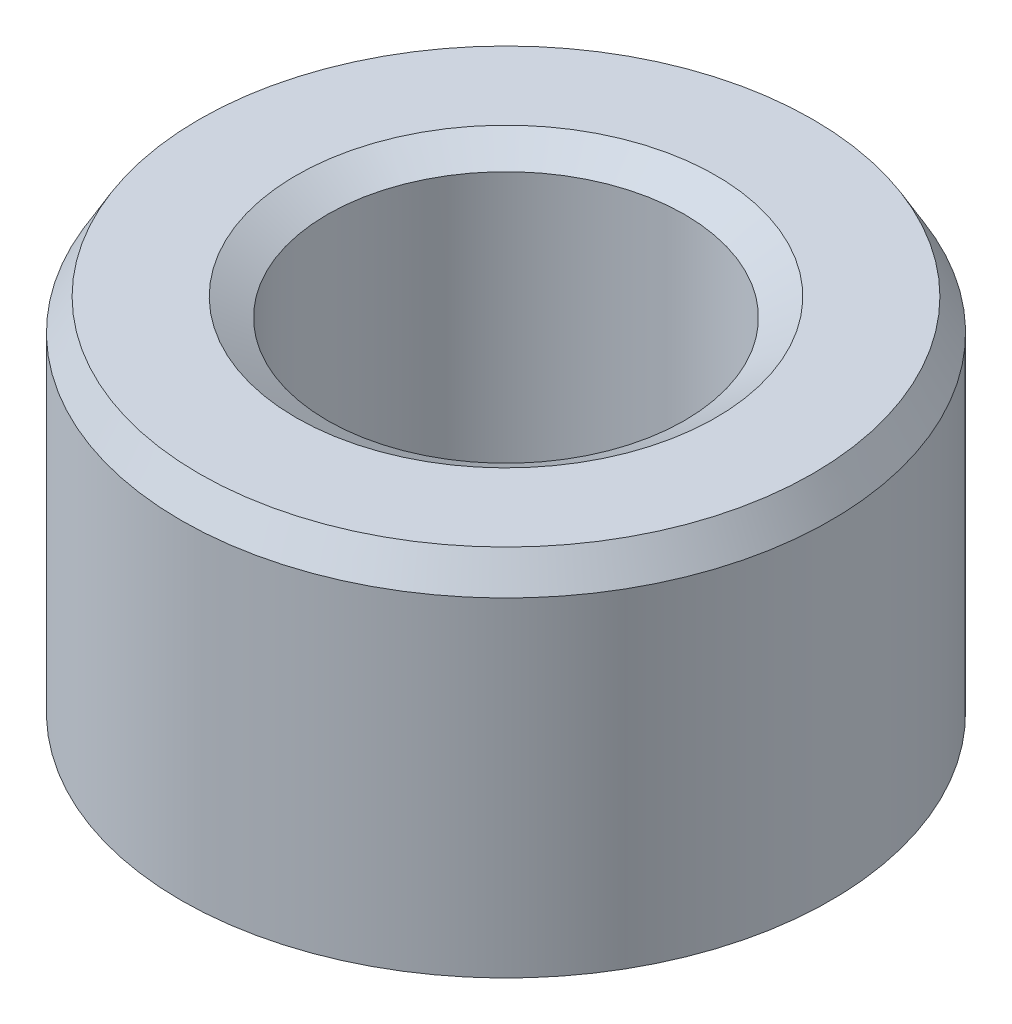
ISO-10303-21;
HEADER;
FILE_DESCRIPTION(('STEP AP214'),'2;1');
FILE_NAME('part.step','',(''),(''),'','','');
FILE_SCHEMA(('AUTOMOTIVE_DESIGN { 1 0 10303 214 1 1 1 1 }'));
ENDSEC;
DATA;
#1=APPLICATION_CONTEXT('core data for automotive mechanical design processes');
#2=APPLICATION_PROTOCOL_DEFINITION('international standard','automotive_design',2000,#1);
#3=PRODUCT_CONTEXT('',#1,'mechanical');
#4=PRODUCT('Part','Part','',(#3));
#5=PRODUCT_RELATED_PRODUCT_CATEGORY('part','',(#4));
#6=PRODUCT_DEFINITION_FORMATION('','',#4);
#7=PRODUCT_DEFINITION_CONTEXT('part definition',#1,'design');
#8=PRODUCT_DEFINITION('design','',#6,#7);
#9=PRODUCT_DEFINITION_SHAPE('','',#8);
#10=(LENGTH_UNIT() NAMED_UNIT(*) SI_UNIT(.MILLI.,.METRE.));
#11=(NAMED_UNIT(*) PLANE_ANGLE_UNIT() SI_UNIT($,.RADIAN.));
#12=(NAMED_UNIT(*) SI_UNIT($,.STERADIAN.) SOLID_ANGLE_UNIT());
#13=UNCERTAINTY_MEASURE_WITH_UNIT(LENGTH_MEASURE(1.E-05),#10,'distance_accuracy_value','');
#14=(GEOMETRIC_REPRESENTATION_CONTEXT(3) GLOBAL_UNCERTAINTY_ASSIGNED_CONTEXT((#13)) GLOBAL_UNIT_ASSIGNED_CONTEXT((#10,
#11,#12)) REPRESENTATION_CONTEXT('',''));
#15=CARTESIAN_POINT('',(0.,0.,0.));
#16=DIRECTION('',(0.,0.,1.));
#17=DIRECTION('',(1.,0.,0.));
#18=AXIS2_PLACEMENT_3D('',#15,#16,#17);
#19=CARTESIAN_POINT('',(0.,37.856817679339,0.));
#20=DIRECTION('',(0.,-1.,0.));
#21=DIRECTION('',(0.,0.,-1.));
#22=AXIS2_PLACEMENT_3D('',#19,#20,#21);
#23=CYLINDRICAL_SURFACE('',#22,32.5);
#24=CARTESIAN_POINT('',(0.,1.81448583222493,0.));
#25=DIRECTION('',(0.,1.,0.));
#26=DIRECTION('',(0.,0.,1.));
#27=AXIS2_PLACEMENT_3D('',#24,#25,#26);
#28=CIRCLE('',#27,32.5);
#29=CARTESIAN_POINT('',(0.,1.81448583222493,32.5));
#30=VERTEX_POINT('',#29);
#31=EDGE_CURVE('E10',#30,#30,#28,.T.);
#32=ORIENTED_EDGE('',*,*,#31,.T.);
#33=EDGE_LOOP('',(#32));
#34=FACE_BOUND('',#33,.T.);
#35=CARTESIAN_POINT('',(0.,34.7248591698607,0.));
#36=DIRECTION('',(0.,1.,0.));
#37=DIRECTION('',(0.,0.,1.));
#38=AXIS2_PLACEMENT_3D('',#35,#36,#37);
#39=CIRCLE('',#38,32.5);
#40=CARTESIAN_POINT('',(0.,34.7248591698607,32.5));
#41=VERTEX_POINT('',#40);
#42=EDGE_CURVE('E50',#41,#41,#39,.F.);
#43=ORIENTED_EDGE('',*,*,#42,.T.);
#44=EDGE_LOOP('',(#43));
#45=FACE_BOUND('',#44,.T.);
#46=ADVANCED_FACE('F39',(#34,#45),#23,.T.);
#47=CARTESIAN_POINT('',(0.,37.856817679339,0.));
#48=DIRECTION('',(0.,1.,0.));
#49=DIRECTION('',(0.,0.,1.));
#50=AXIS2_PLACEMENT_3D('',#47,#48,#49);
#51=PLANE('',#50);
#52=CARTESIAN_POINT('',(0.,37.856817679339,0.));
#53=DIRECTION('',(0.,1.,0.));
#54=DIRECTION('',(0.,0.,1.));
#55=AXIS2_PLACEMENT_3D('',#52,#53,#54);
#56=CIRCLE('',#55,20.9881499443453);
#57=CARTESIAN_POINT('',(0.,37.856817679339,20.9881499443453));
#58=VERTEX_POINT('',#57);
#59=EDGE_CURVE('E58',#58,#58,#56,.F.);
#60=ORIENTED_EDGE('',*,*,#59,.T.);
#61=EDGE_LOOP('',(#60));
#62=FACE_BOUND('',#61,.T.);
#63=CARTESIAN_POINT('',(0.,37.856817679339,0.));
#64=DIRECTION('',(0.,1.,0.));
#65=DIRECTION('',(0.,0.,1.));
#66=AXIS2_PLACEMENT_3D('',#63,#64,#65);
#67=CIRCLE('',#66,30.6855141677751);
#68=CARTESIAN_POINT('',(0.,37.856817679339,30.6855141677751));
#69=VERTEX_POINT('',#68);
#70=EDGE_CURVE('E61',#69,#69,#67,.T.);
#71=ORIENTED_EDGE('',*,*,#70,.T.);
#72=EDGE_LOOP('',(#71));
#73=FACE_BOUND('',#72,.T.);
#74=ADVANCED_FACE('F88',(#62,#73),#51,.T.);
#75=CARTESIAN_POINT('',(0.,0.,0.));
#76=DIRECTION('',(0.,1.,0.));
#77=DIRECTION('',(0.,0.,1.));
#78=AXIS2_PLACEMENT_3D('',#75,#76,#77);
#79=PLANE('',#78);
#80=CARTESIAN_POINT('',(0.,0.,0.));
#81=DIRECTION('',(0.,1.,0.));
#82=DIRECTION('',(0.,0.,1.));
#83=AXIS2_PLACEMENT_3D('',#80,#81,#82);
#84=CIRCLE('',#83,19.670677267092);
#85=CARTESIAN_POINT('',(0.,0.,-19.670677267092));
#86=VERTEX_POINT('',#85);
#87=EDGE_CURVE('E51',#86,#86,#84,.T.);
#88=ORIENTED_EDGE('',*,*,#87,.T.);
#89=EDGE_LOOP('',(#88));
#90=FACE_BOUND('',#89,.T.);
#91=CARTESIAN_POINT('',(0.,0.,0.));
#92=DIRECTION('',(0.,1.,0.));
#93=DIRECTION('',(0.,0.,1.));
#94=AXIS2_PLACEMENT_3D('',#91,#92,#93);
#95=CIRCLE('',#94,29.3680414905218);
#96=CARTESIAN_POINT('',(0.,0.,29.3680414905218));
#97=VERTEX_POINT('',#96);
#98=EDGE_CURVE('E54',#97,#97,#95,.F.);
#99=ORIENTED_EDGE('',*,*,#98,.T.);
#100=EDGE_LOOP('',(#99));
#101=FACE_BOUND('',#100,.T.);
#102=ADVANCED_FACE('F83',(#90,#101),#79,.F.);
#103=CARTESIAN_POINT('',(0.,37.856817679339,0.));
#104=DIRECTION('',(0.,-1.,0.));
#105=DIRECTION('',(0.,0.,-1.));
#106=AXIS2_PLACEMENT_3D('',#103,#104,#105);
#107=CYLINDRICAL_SURFACE('',#106,17.8561914348671);
#108=CARTESIAN_POINT('',(0.,36.042331847114,0.));
#109=DIRECTION('',(0.,1.,0.));
#110=DIRECTION('',(0.,0.,1.));
#111=AXIS2_PLACEMENT_3D('',#108,#109,#110);
#112=CIRCLE('',#111,17.8561914348671);
#113=CARTESIAN_POINT('',(0.,36.042331847114,17.8561914348671));
#114=VERTEX_POINT('',#113);
#115=EDGE_CURVE('E67',#114,#114,#112,.T.);
#116=ORIENTED_EDGE('',*,*,#115,.T.);
#117=EDGE_LOOP('',(#116));
#118=FACE_BOUND('',#117,.T.);
#119=CARTESIAN_POINT('',(0.,3.13195850947821,0.));
#120=DIRECTION('',(0.,1.,0.));
#121=DIRECTION('',(0.,0.,1.));
#122=AXIS2_PLACEMENT_3D('',#119,#120,#121);
#123=CIRCLE('',#122,17.8561914348671);
#124=CARTESIAN_POINT('',(0.,3.13195850947821,-17.8561914348671));
#125=VERTEX_POINT('',#124);
#126=EDGE_CURVE('E69',#125,#125,#123,.F.);
#127=ORIENTED_EDGE('',*,*,#126,.T.);
#128=EDGE_LOOP('',(#127));
#129=FACE_BOUND('',#128,.T.);
#130=ADVANCED_FACE('F71',(#118,#129),#107,.F.);
#131=CARTESIAN_POINT('',(0.,36.042331847114,0.));
#132=DIRECTION('',(0.,1.,0.));
#133=DIRECTION('',(0.,0.,1.));
#134=AXIS2_PLACEMENT_3D('',#131,#132,#133);
#135=CONICAL_SURFACE('',#134,17.8561914348671,1.04570247745584);
#136=ORIENTED_EDGE('',*,*,#59,.F.);
#137=EDGE_LOOP('',(#136));
#138=FACE_BOUND('',#137,.T.);
#139=ORIENTED_EDGE('',*,*,#115,.F.);
#140=EDGE_LOOP('',(#139));
#141=FACE_BOUND('',#140,.T.);
#142=ADVANCED_FACE('F77',(#138,#141),#135,.F.);
#143=CARTESIAN_POINT('',(0.,0.,0.));
#144=DIRECTION('',(0.,-1.,0.));
#145=DIRECTION('',(0.,0.,-1.));
#146=AXIS2_PLACEMENT_3D('',#143,#144,#145);
#147=CONICAL_SURFACE('',#146,19.670677267092,0.525093849339053);
#148=CARTESIAN_POINT('',(0.,3.13195850947821,-17.8561914348671));
#149=CARTESIAN_POINT('',(0.,3.09933394167115,-17.8750923289527));
#150=CARTESIAN_POINT('',(0.,3.06670937386408,-17.8939932230384));
#151=CARTESIAN_POINT('',(0.,3.00146023824995,-17.9317950112098));
#152=CARTESIAN_POINT('',(0.,2.96883567044289,-17.9506959052955));
#153=CARTESIAN_POINT('',(0.,2.90358653482876,-17.9884976934668));
#154=CARTESIAN_POINT('',(0.,2.8709619670217,-18.0073985875525));
#155=CARTESIAN_POINT('',(0.,2.80571283140757,-18.0452003757238));
#156=CARTESIAN_POINT('',(0.,2.7730882636005,-18.0641012698095));
#157=CARTESIAN_POINT('',(0.,2.70783912798637,-18.1019030579809));
#158=CARTESIAN_POINT('',(0.,2.67521456017931,-18.1208039520665));
#159=CARTESIAN_POINT('',(0.,2.60996542456518,-18.1586057402379));
#160=CARTESIAN_POINT('',(0.,2.57734085675811,-18.1775066343236));
#161=CARTESIAN_POINT('',(0.,2.51209172114398,-18.2153084224949));
#162=CARTESIAN_POINT('',(0.,2.47946715333692,-18.2342093165806));
#163=CARTESIAN_POINT('',(0.,2.41421801772279,-18.2720111047519));
#164=CARTESIAN_POINT('',(0.,2.38159344991572,-18.2909119988376));
#165=CARTESIAN_POINT('',(0.,2.31634431430159,-18.328713787009));
#166=CARTESIAN_POINT('',(0.,2.28371974649453,-18.3476146810947));
#167=CARTESIAN_POINT('',(0.,2.2184706108804,-18.385416469266));
#168=CARTESIAN_POINT('',(0.,2.18584604307334,-18.4043173633517));
#169=CARTESIAN_POINT('',(0.,2.12059690745921,-18.442119151523));
#170=CARTESIAN_POINT('',(0.,2.08797233965214,-18.4610200456087));
#171=CARTESIAN_POINT('',(0.,2.02272320403801,-18.4988218337801));
#172=CARTESIAN_POINT('',(0.,1.99009863623095,-18.5177227278657));
#173=CARTESIAN_POINT('',(0.,1.92484950061682,-18.5555245160371));
#174=CARTESIAN_POINT('',(0.,1.89222493280975,-18.5744254101228));
#175=CARTESIAN_POINT('',(0.,1.82697579719562,-18.6122271982941));
#176=CARTESIAN_POINT('',(0.,1.79435122938856,-18.6311280923798));
#177=CARTESIAN_POINT('',(0.,1.72910209377443,-18.6689298805512));
#178=CARTESIAN_POINT('',(0.,1.69647752596737,-18.6878307746368));
#179=CARTESIAN_POINT('',(0.,1.63122839035324,-18.7256325628082));
#180=CARTESIAN_POINT('',(0.,1.59860382254617,-18.7445334568939));
#181=CARTESIAN_POINT('',(0.,1.53335468693204,-18.7823352450652));
#182=CARTESIAN_POINT('',(0.,1.50073011912498,-18.8012361391509));
#183=CARTESIAN_POINT('',(0.,1.43548098351085,-18.8390379273222));
#184=CARTESIAN_POINT('',(0.,1.40285641570378,-18.8579388214079));
#185=CARTESIAN_POINT('',(0.,1.33760728008965,-18.8957406095793));
#186=CARTESIAN_POINT('',(0.,1.30498271228259,-18.9146415036649));
#187=CARTESIAN_POINT('',(0.,1.23973357666846,-18.9524432918363));
#188=CARTESIAN_POINT('',(0.,1.20710900886139,-18.971344185922));
#189=CARTESIAN_POINT('',(0.,1.14185987324726,-19.0091459740933));
#190=CARTESIAN_POINT('',(0.,1.1092353054402,-19.028046868179));
#191=CARTESIAN_POINT('',(0.,1.04398616982607,-19.0658486563504));
#192=CARTESIAN_POINT('',(0.,1.01136160201901,-19.084749550436));
#193=CARTESIAN_POINT('',(0.,0.946112466404877,-19.1225513386074));
#194=CARTESIAN_POINT('',(0.,0.913487898597812,-19.1414522326931));
#195=CARTESIAN_POINT('',(0.,0.848238762983683,-19.1792540208644));
#196=CARTESIAN_POINT('',(0.,0.815614195176618,-19.1981549149501));
#197=CARTESIAN_POINT('',(0.,0.750365059562489,-19.2359567031214));
#198=CARTESIAN_POINT('',(0.,0.717740491755424,-19.2548575972071));
#199=CARTESIAN_POINT('',(0.,0.652491356141294,-19.2926593853785));
#200=CARTESIAN_POINT('',(0.,0.61986678833423,-19.3115602794641));
#201=CARTESIAN_POINT('',(0.,0.554617652720101,-19.3493620676355));
#202=CARTESIAN_POINT('',(0.,0.521993084913036,-19.3682629617212));
#203=CARTESIAN_POINT('',(0.,0.456743949298906,-19.4060647498925));
#204=CARTESIAN_POINT('',(0.,0.424119381491841,-19.4249656439782));
#205=CARTESIAN_POINT('',(0.,0.358870245877712,-19.4627674321496));
#206=CARTESIAN_POINT('',(0.,0.326245678070647,-19.4816683262352));
#207=CARTESIAN_POINT('',(0.,0.260996542456518,-19.5194701144066));
#208=CARTESIAN_POINT('',(0.,0.228371974649453,-19.5383710084923));
#209=CARTESIAN_POINT('',(0.,0.163122839035323,-19.5761727966636));
#210=CARTESIAN_POINT('',(0.,0.130498271228259,-19.5950736907493));
#211=CARTESIAN_POINT('',(0.,0.06524913561413,-19.6328754789206));
#212=CARTESIAN_POINT('',(0.,0.0326245678070655,-19.6517763730063));
#213=CARTESIAN_POINT('',(0.,0.,-19.670677267092));
#214=B_SPLINE_CURVE_WITH_KNOTS('',3,(#148,#149,#150,#151,#152,#153,#154,#155,#156,#157,#158,
#159,#160,#161,#162,#163,#164,#165,#166,#167,#168,#169,#170,#171,#172,#173,#174,#175,#176,#177,
#178,#179,#180,#181,#182,#183,#184,#185,#186,#187,#188,#189,#190,#191,#192,#193,#194,#195,#196,
#197,#198,#199,#200,#201,#202,#203,#204,#205,#206,#207,#208,#209,#210,#211,#212,#213),
.UNSPECIFIED.,.F.,.F.,(4,2,2,2,2,2,2,2,2,2,2,2,2,2,2,2,2,2,2,2,2,2,2,2,2,2,2,2,2,2,2,2,4),(0.,
0.113112581070902,0.226225162141805,0.339337743212707,0.45245032428361,0.565562905354512,
0.678675486425413,0.791788067496317,0.904900648567218,1.01801322963812,1.13112581070902,
1.24423839177993,1.35735097285083,1.47046355392173,1.58357613499263,1.69668871606353,
1.80980129713444,1.92291387820534,2.03602645927624,2.14913904034714,2.26225162141805,
2.37536420248895,2.48847678355985,2.60158936463075,2.71470194570166,2.82781452677256,
2.94092710784346,3.05403968891436,3.16715226998526,3.28026485105617,3.39337743212707,
3.50649001319797,3.61960259426887),.UNSPECIFIED.);
#215=EDGE_CURVE('BSEAM73',#125,#86,#214,.T.);
#216=ORIENTED_EDGE('',*,*,#126,.F.);
#217=ORIENTED_EDGE('',*,*,#87,.F.);
#218=ORIENTED_EDGE('',*,*,#215,.T.);
#219=ORIENTED_EDGE('',*,*,#215,.F.);
#220=EDGE_LOOP('',(#216,#218,#217,#219));
#221=FACE_BOUND('',#220,.T.);
#222=ADVANCED_FACE('F73',(#221),#147,.F.);
#223=CARTESIAN_POINT('',(0.,1.81448583222493,0.));
#224=DIRECTION('',(0.,1.,0.));
#225=DIRECTION('',(0.,0.,1.));
#226=AXIS2_PLACEMENT_3D('',#223,#224,#225);
#227=CONICAL_SURFACE('',#226,32.5,1.04570247745584);
#228=ORIENTED_EDGE('',*,*,#98,.F.);
#229=EDGE_LOOP('',(#228));
#230=FACE_BOUND('',#229,.T.);
#231=ORIENTED_EDGE('',*,*,#31,.F.);
#232=EDGE_LOOP('',(#231));
#233=FACE_BOUND('',#232,.T.);
#234=ADVANCED_FACE('F76',(#230,#233),#227,.T.);
#235=CARTESIAN_POINT('',(0.,37.856817679339,0.));
#236=DIRECTION('',(0.,-1.,0.));
#237=DIRECTION('',(0.,0.,-1.));
#238=AXIS2_PLACEMENT_3D('',#235,#236,#237);
#239=CONICAL_SURFACE('',#238,30.6855141677751,0.525093849339052);
#240=ORIENTED_EDGE('',*,*,#42,.F.);
#241=EDGE_LOOP('',(#240));
#242=FACE_BOUND('',#241,.T.);
#243=ORIENTED_EDGE('',*,*,#70,.F.);
#244=EDGE_LOOP('',(#243));
#245=FACE_BOUND('',#244,.T.);
#246=ADVANCED_FACE('F45',(#242,#245),#239,.T.);
#247=CLOSED_SHELL('',(#46,#74,#102,#130,#142,#222,#234,#246));
#248=MANIFOLD_SOLID_BREP('B2',#247);
#249=ADVANCED_BREP_SHAPE_REPRESENTATION('',(#18,#248),#14);
#250=SHAPE_DEFINITION_REPRESENTATION(#9,#249);
ENDSEC;
END-ISO-10303-21;
